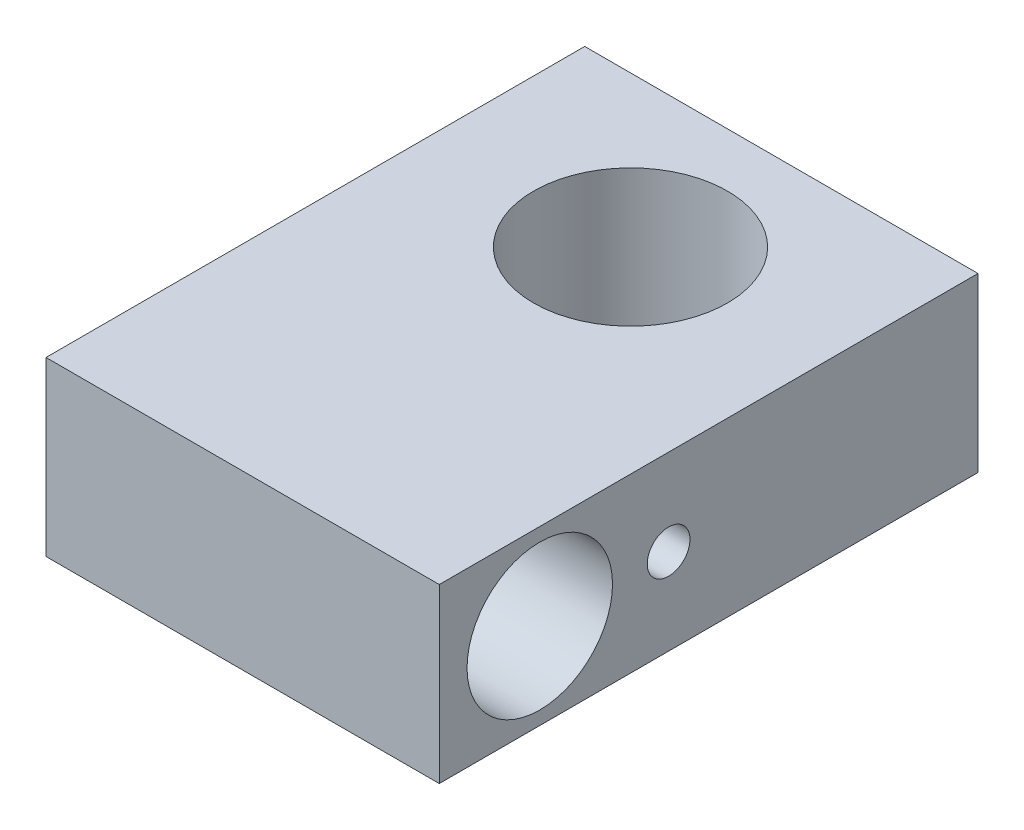
ISO-10303-21;
HEADER;
FILE_DESCRIPTION(('STEP AP214'),'2;1');
FILE_NAME('part.step','',(''),(''),'','','');
FILE_SCHEMA(('AUTOMOTIVE_DESIGN { 1 0 10303 214 1 1 1 1 }'));
ENDSEC;
DATA;
#1=APPLICATION_CONTEXT('core data for automotive mechanical design processes');
#2=APPLICATION_PROTOCOL_DEFINITION('international standard','automotive_design',2000,#1);
#3=PRODUCT_CONTEXT('',#1,'mechanical');
#4=PRODUCT('Part','Part','',(#3));
#5=PRODUCT_RELATED_PRODUCT_CATEGORY('part','',(#4));
#6=PRODUCT_DEFINITION_FORMATION('','',#4);
#7=PRODUCT_DEFINITION_CONTEXT('part definition',#1,'design');
#8=PRODUCT_DEFINITION('design','',#6,#7);
#9=PRODUCT_DEFINITION_SHAPE('','',#8);
#10=(LENGTH_UNIT() NAMED_UNIT(*) SI_UNIT(.MILLI.,.METRE.));
#11=(NAMED_UNIT(*) PLANE_ANGLE_UNIT() SI_UNIT($,.RADIAN.));
#12=(NAMED_UNIT(*) SI_UNIT($,.STERADIAN.) SOLID_ANGLE_UNIT());
#13=UNCERTAINTY_MEASURE_WITH_UNIT(LENGTH_MEASURE(1.E-05),#10,'distance_accuracy_value','');
#14=(GEOMETRIC_REPRESENTATION_CONTEXT(3) GLOBAL_UNCERTAINTY_ASSIGNED_CONTEXT((#13)) GLOBAL_UNIT_ASSIGNED_CONTEXT((#10,
#11,#12)) REPRESENTATION_CONTEXT('',''));
#15=CARTESIAN_POINT('',(0.,0.,0.));
#16=DIRECTION('',(0.,0.,1.));
#17=DIRECTION('',(1.,0.,0.));
#18=AXIS2_PLACEMENT_3D('',#15,#16,#17);
#19=CARTESIAN_POINT('',(-9.125,8.,-7.));
#20=DIRECTION('',(0.,0.,1.));
#21=DIRECTION('',(1.,0.,0.));
#22=AXIS2_PLACEMENT_3D('',#19,#20,#21);
#23=PLANE('',#22);
#24=DIRECTION('',(-1.,0.,0.));
#25=VECTOR('',#24,1.);
#26=CARTESIAN_POINT('',(-9.125,0.,-7.));
#27=LINE('',#26,#25);
#28=CARTESIAN_POINT('',(9.125,0.,-6.99999999999999));
#29=VERTEX_POINT('',#28);
#30=CARTESIAN_POINT('',(-9.125,0.,-7.));
#31=VERTEX_POINT('',#30);
#32=EDGE_CURVE('E109',#29,#31,#27,.T.);
#33=ORIENTED_EDGE('',*,*,#32,.T.);
#34=DIRECTION('',(0.,-1.,0.));
#35=VECTOR('',#34,1.);
#36=CARTESIAN_POINT('',(-9.125,8.,-7.));
#37=LINE('',#36,#35);
#38=CARTESIAN_POINT('',(-9.125,8.,-7.));
#39=VERTEX_POINT('',#38);
#40=EDGE_CURVE('E13',#39,#31,#37,.T.);
#41=ORIENTED_EDGE('',*,*,#40,.F.);
#42=DIRECTION('',(-1.,0.,0.));
#43=VECTOR('',#42,1.);
#44=CARTESIAN_POINT('',(-9.125,8.,-7.));
#45=LINE('',#44,#43);
#46=CARTESIAN_POINT('',(9.125,8.,-6.99999999999999));
#47=VERTEX_POINT('',#46);
#48=EDGE_CURVE('E97',#47,#39,#45,.T.);
#49=ORIENTED_EDGE('',*,*,#48,.F.);
#50=DIRECTION('',(0.,-1.,0.));
#51=VECTOR('',#50,1.);
#52=CARTESIAN_POINT('',(9.125,8.,-6.99999999999999));
#53=LINE('',#52,#51);
#54=EDGE_CURVE('E105',#47,#29,#53,.T.);
#55=ORIENTED_EDGE('',*,*,#54,.T.);
#56=EDGE_LOOP('',(#33,#41,#49,#55));
#57=FACE_BOUND('',#56,.T.);
#58=ADVANCED_FACE('F46',(#57),#23,.F.);
#59=CARTESIAN_POINT('',(-9.125,8.,18.));
#60=DIRECTION('',(1.,0.,0.));
#61=DIRECTION('',(0.,0.,-1.));
#62=AXIS2_PLACEMENT_3D('',#59,#60,#61);
#63=PLANE('',#62);
#64=CARTESIAN_POINT('',(-9.125,4.,7.3575));
#65=DIRECTION('',(1.,0.,0.));
#66=DIRECTION('',(0.,0.,-1.));
#67=AXIS2_PLACEMENT_3D('',#64,#65,#66);
#68=CIRCLE('',#67,0.990599999999999);
#69=CARTESIAN_POINT('',(-9.125,4.,6.3669));
#70=VERTEX_POINT('',#69);
#71=EDGE_CURVE('E132',#70,#70,#68,.T.);
#72=ORIENTED_EDGE('',*,*,#71,.T.);
#73=EDGE_LOOP('',(#72));
#74=FACE_BOUND('',#73,.T.);
#75=CARTESIAN_POINT('',(-9.125,4.,13.336186812336));
#76=DIRECTION('',(1.,0.,0.));
#77=DIRECTION('',(0.,0.,-1.));
#78=AXIS2_PLACEMENT_3D('',#75,#76,#77);
#79=CIRCLE('',#78,3.375);
#80=CARTESIAN_POINT('',(-9.125,4.,9.96118681233597));
#81=VERTEX_POINT('',#80);
#82=EDGE_CURVE('E128',#81,#81,#79,.T.);
#83=ORIENTED_EDGE('',*,*,#82,.T.);
#84=EDGE_LOOP('',(#83));
#85=FACE_BOUND('',#84,.T.);
#86=DIRECTION('',(0.,0.,1.));
#87=VECTOR('',#86,1.);
#88=CARTESIAN_POINT('',(-9.125,0.,18.));
#89=LINE('',#88,#87);
#90=CARTESIAN_POINT('',(-9.125,0.,18.));
#91=VERTEX_POINT('',#90);
#92=EDGE_CURVE('E101',#31,#91,#89,.T.);
#93=ORIENTED_EDGE('',*,*,#92,.T.);
#94=DIRECTION('',(0.,-1.,0.));
#95=VECTOR('',#94,1.);
#96=CARTESIAN_POINT('',(-9.125,8.,18.));
#97=LINE('',#96,#95);
#98=CARTESIAN_POINT('',(-9.125,8.,18.));
#99=VERTEX_POINT('',#98);
#100=EDGE_CURVE('E54',#99,#91,#97,.T.);
#101=ORIENTED_EDGE('',*,*,#100,.F.);
#102=DIRECTION('',(0.,0.,1.));
#103=VECTOR('',#102,1.);
#104=CARTESIAN_POINT('',(-9.125,8.,18.));
#105=LINE('',#104,#103);
#106=EDGE_CURVE('E92',#39,#99,#105,.T.);
#107=ORIENTED_EDGE('',*,*,#106,.F.);
#108=ORIENTED_EDGE('',*,*,#40,.T.);
#109=EDGE_LOOP('',(#93,#101,#107,#108));
#110=FACE_BOUND('',#109,.T.);
#111=ADVANCED_FACE('F100',(#74,#85,#110),#63,.F.);
#112=CARTESIAN_POINT('',(9.125,8.,18.));
#113=DIRECTION('',(0.,0.,-1.));
#114=DIRECTION('',(-1.,0.,0.));
#115=AXIS2_PLACEMENT_3D('',#112,#113,#114);
#116=PLANE('',#115);
#117=DIRECTION('',(1.,0.,0.));
#118=VECTOR('',#117,1.);
#119=CARTESIAN_POINT('',(9.125,0.,18.));
#120=LINE('',#119,#118);
#121=CARTESIAN_POINT('',(9.125,0.,18.));
#122=VERTEX_POINT('',#121);
#123=EDGE_CURVE('E79',#91,#122,#120,.T.);
#124=ORIENTED_EDGE('',*,*,#123,.T.);
#125=DIRECTION('',(0.,-1.,0.));
#126=VECTOR('',#125,1.);
#127=CARTESIAN_POINT('',(9.125,8.,18.));
#128=LINE('',#127,#126);
#129=CARTESIAN_POINT('',(9.125,8.,18.));
#130=VERTEX_POINT('',#129);
#131=EDGE_CURVE('E102',#130,#122,#128,.T.);
#132=ORIENTED_EDGE('',*,*,#131,.F.);
#133=DIRECTION('',(1.,0.,0.));
#134=VECTOR('',#133,1.);
#135=CARTESIAN_POINT('',(9.125,8.,18.));
#136=LINE('',#135,#134);
#137=EDGE_CURVE('E95',#99,#130,#136,.T.);
#138=ORIENTED_EDGE('',*,*,#137,.F.);
#139=ORIENTED_EDGE('',*,*,#100,.T.);
#140=EDGE_LOOP('',(#124,#132,#138,#139));
#141=FACE_BOUND('',#140,.T.);
#142=ADVANCED_FACE('F103',(#141),#116,.F.);
#143=CARTESIAN_POINT('',(9.125,8.,-6.99999999999999));
#144=DIRECTION('',(-1.,0.,0.));
#145=DIRECTION('',(0.,0.,1.));
#146=AXIS2_PLACEMENT_3D('',#143,#144,#145);
#147=PLANE('',#146);
#148=CARTESIAN_POINT('',(9.125,4.,7.3575));
#149=DIRECTION('',(1.,0.,0.));
#150=DIRECTION('',(0.,0.,-1.));
#151=AXIS2_PLACEMENT_3D('',#148,#149,#150);
#152=CIRCLE('',#151,0.990599999999999);
#153=CARTESIAN_POINT('',(9.125,4.,6.3669));
#154=VERTEX_POINT('',#153);
#155=EDGE_CURVE('E135',#154,#154,#152,.T.);
#156=ORIENTED_EDGE('',*,*,#155,.F.);
#157=EDGE_LOOP('',(#156));
#158=FACE_BOUND('',#157,.T.);
#159=CARTESIAN_POINT('',(9.125,4.,13.336186812336));
#160=DIRECTION('',(1.,0.,0.));
#161=DIRECTION('',(0.,0.,-1.));
#162=AXIS2_PLACEMENT_3D('',#159,#160,#161);
#163=CIRCLE('',#162,3.375);
#164=CARTESIAN_POINT('',(9.125,4.,9.96118681233597));
#165=VERTEX_POINT('',#164);
#166=EDGE_CURVE('E129',#165,#165,#163,.T.);
#167=ORIENTED_EDGE('',*,*,#166,.F.);
#168=EDGE_LOOP('',(#167));
#169=FACE_BOUND('',#168,.T.);
#170=DIRECTION('',(0.,0.,-1.));
#171=VECTOR('',#170,1.);
#172=CARTESIAN_POINT('',(9.125,0.,-6.99999999999999));
#173=LINE('',#172,#171);
#174=EDGE_CURVE('E85',#122,#29,#173,.T.);
#175=ORIENTED_EDGE('',*,*,#174,.T.);
#176=ORIENTED_EDGE('',*,*,#54,.F.);
#177=DIRECTION('',(0.,0.,-1.));
#178=VECTOR('',#177,1.);
#179=CARTESIAN_POINT('',(9.125,8.,-6.99999999999999));
#180=LINE('',#179,#178);
#181=EDGE_CURVE('E62',#130,#47,#180,.T.);
#182=ORIENTED_EDGE('',*,*,#181,.F.);
#183=ORIENTED_EDGE('',*,*,#131,.T.);
#184=EDGE_LOOP('',(#175,#176,#182,#183));
#185=FACE_BOUND('',#184,.T.);
#186=ADVANCED_FACE('F117',(#158,#169,#185),#147,.F.);
#187=CARTESIAN_POINT('',(9.125,8.,-6.99999999999999));
#188=DIRECTION('',(0.,-1.,0.));
#189=DIRECTION('',(0.,0.,-1.));
#190=AXIS2_PLACEMENT_3D('',#187,#188,#189);
#191=PLANE('',#190);
#192=CARTESIAN_POINT('',(0.,8.,0.));
#193=DIRECTION('',(0.,1.,0.));
#194=DIRECTION('',(0.,0.,1.));
#195=AXIS2_PLACEMENT_3D('',#192,#193,#194);
#196=CIRCLE('',#195,4.5);
#197=CARTESIAN_POINT('',(0.,8.,4.5));
#198=VERTEX_POINT('',#197);
#199=EDGE_CURVE('E125',#198,#198,#196,.T.);
#200=ORIENTED_EDGE('',*,*,#199,.F.);
#201=EDGE_LOOP('',(#200));
#202=FACE_BOUND('',#201,.T.);
#203=ORIENTED_EDGE('',*,*,#48,.T.);
#204=ORIENTED_EDGE('',*,*,#106,.T.);
#205=ORIENTED_EDGE('',*,*,#137,.T.);
#206=ORIENTED_EDGE('',*,*,#181,.T.);
#207=EDGE_LOOP('',(#203,#204,#205,#206));
#208=FACE_BOUND('',#207,.T.);
#209=ADVANCED_FACE('F93',(#202,#208),#191,.F.);
#210=CARTESIAN_POINT('',(9.125,0.,-6.99999999999999));
#211=DIRECTION('',(0.,-1.,0.));
#212=DIRECTION('',(0.,0.,-1.));
#213=AXIS2_PLACEMENT_3D('',#210,#211,#212);
#214=PLANE('',#213);
#215=CARTESIAN_POINT('',(0.,0.,0.));
#216=DIRECTION('',(0.,1.,0.));
#217=DIRECTION('',(0.,0.,1.));
#218=AXIS2_PLACEMENT_3D('',#215,#216,#217);
#219=CIRCLE('',#218,4.5);
#220=CARTESIAN_POINT('',(0.,0.,4.5));
#221=VERTEX_POINT('',#220);
#222=EDGE_CURVE('E112',#221,#221,#219,.T.);
#223=ORIENTED_EDGE('',*,*,#222,.T.);
#224=EDGE_LOOP('',(#223));
#225=FACE_BOUND('',#224,.T.);
#226=ORIENTED_EDGE('',*,*,#32,.F.);
#227=ORIENTED_EDGE('',*,*,#174,.F.);
#228=ORIENTED_EDGE('',*,*,#123,.F.);
#229=ORIENTED_EDGE('',*,*,#92,.F.);
#230=EDGE_LOOP('',(#226,#227,#228,#229));
#231=FACE_BOUND('',#230,.T.);
#232=ADVANCED_FACE('F120',(#225,#231),#214,.T.);
#233=CARTESIAN_POINT('',(0.,8.,0.));
#234=DIRECTION('',(0.,1.,0.));
#235=DIRECTION('',(0.,0.,1.));
#236=AXIS2_PLACEMENT_3D('',#233,#234,#235);
#237=CYLINDRICAL_SURFACE('',#236,4.5);
#238=ORIENTED_EDGE('',*,*,#222,.F.);
#239=EDGE_LOOP('',(#238));
#240=FACE_BOUND('',#239,.T.);
#241=ORIENTED_EDGE('',*,*,#199,.T.);
#242=EDGE_LOOP('',(#241));
#243=FACE_BOUND('',#242,.T.);
#244=ADVANCED_FACE('F156',(#240,#243),#237,.F.);
#245=CARTESIAN_POINT('',(-9.125,4.,13.336186812336));
#246=DIRECTION('',(1.,0.,0.));
#247=DIRECTION('',(0.,0.,-1.));
#248=AXIS2_PLACEMENT_3D('',#245,#246,#247);
#249=CYLINDRICAL_SURFACE('',#248,3.375);
#250=ORIENTED_EDGE('',*,*,#82,.F.);
#251=EDGE_LOOP('',(#250));
#252=FACE_BOUND('',#251,.T.);
#253=ORIENTED_EDGE('',*,*,#166,.T.);
#254=EDGE_LOOP('',(#253));
#255=FACE_BOUND('',#254,.T.);
#256=ADVANCED_FACE('F146',(#252,#255),#249,.F.);
#257=CARTESIAN_POINT('',(-9.125,4.,7.3575));
#258=DIRECTION('',(1.,0.,0.));
#259=DIRECTION('',(0.,0.,-1.));
#260=AXIS2_PLACEMENT_3D('',#257,#258,#259);
#261=CYLINDRICAL_SURFACE('',#260,0.990599999999999);
#262=ORIENTED_EDGE('',*,*,#71,.F.);
#263=EDGE_LOOP('',(#262));
#264=FACE_BOUND('',#263,.T.);
#265=ORIENTED_EDGE('',*,*,#155,.T.);
#266=EDGE_LOOP('',(#265));
#267=FACE_BOUND('',#266,.T.);
#268=ADVANCED_FACE('F143',(#264,#267),#261,.F.);
#269=CLOSED_SHELL('',(#58,#111,#142,#186,#209,#232,#244,#256,#268));
#270=MANIFOLD_SOLID_BREP('B2',#269);
#271=ADVANCED_BREP_SHAPE_REPRESENTATION('',(#18,#270),#14);
#272=SHAPE_DEFINITION_REPRESENTATION(#9,#271);
ENDSEC;
END-ISO-10303-21;
